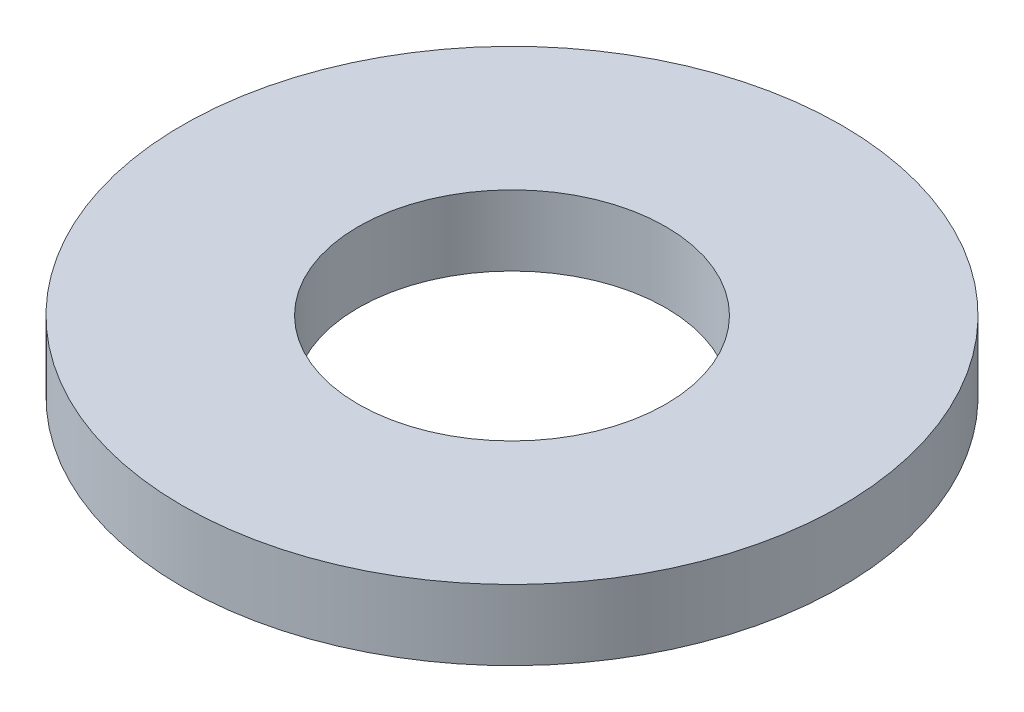
ISO-10303-21;
HEADER;
FILE_DESCRIPTION(('STEP AP214'),'2;1');
FILE_NAME('part.step','',(''),(''),'','','');
FILE_SCHEMA(('AUTOMOTIVE_DESIGN { 1 0 10303 214 1 1 1 1 }'));
ENDSEC;
DATA;
#1=APPLICATION_CONTEXT('core data for automotive mechanical design processes');
#2=APPLICATION_PROTOCOL_DEFINITION('international standard','automotive_design',2000,#1);
#3=PRODUCT_CONTEXT('',#1,'mechanical');
#4=PRODUCT('Part','Part','',(#3));
#5=PRODUCT_RELATED_PRODUCT_CATEGORY('part','',(#4));
#6=PRODUCT_DEFINITION_FORMATION('','',#4);
#7=PRODUCT_DEFINITION_CONTEXT('part definition',#1,'design');
#8=PRODUCT_DEFINITION('design','',#6,#7);
#9=PRODUCT_DEFINITION_SHAPE('','',#8);
#10=(LENGTH_UNIT() NAMED_UNIT(*) SI_UNIT(.MILLI.,.METRE.));
#11=(NAMED_UNIT(*) PLANE_ANGLE_UNIT() SI_UNIT($,.RADIAN.));
#12=(NAMED_UNIT(*) SI_UNIT($,.STERADIAN.) SOLID_ANGLE_UNIT());
#13=UNCERTAINTY_MEASURE_WITH_UNIT(LENGTH_MEASURE(1.E-05),#10,'distance_accuracy_value','');
#14=(GEOMETRIC_REPRESENTATION_CONTEXT(3) GLOBAL_UNCERTAINTY_ASSIGNED_CONTEXT((#13)) GLOBAL_UNIT_ASSIGNED_CONTEXT((#10,
#11,#12)) REPRESENTATION_CONTEXT('',''));
#15=CARTESIAN_POINT('',(0.,0.,0.));
#16=DIRECTION('',(0.,0.,1.));
#17=DIRECTION('',(1.,0.,0.));
#18=AXIS2_PLACEMENT_3D('',#15,#16,#17);
#19=CARTESIAN_POINT('',(0.,8.,0.));
#20=DIRECTION('',(0.,-1.,0.));
#21=DIRECTION('',(0.,0.,-1.));
#22=AXIS2_PLACEMENT_3D('',#19,#20,#21);
#23=CYLINDRICAL_SURFACE('',#22,37.5);
#24=CARTESIAN_POINT('',(0.,8.,0.));
#25=DIRECTION('',(0.,1.,0.));
#26=DIRECTION('',(0.,0.,1.));
#27=AXIS2_PLACEMENT_3D('',#24,#25,#26);
#28=CIRCLE('',#27,37.5);
#29=CARTESIAN_POINT('',(0.,8.,37.5));
#30=VERTEX_POINT('',#29);
#31=EDGE_CURVE('E10',#30,#30,#28,.T.);
#32=ORIENTED_EDGE('',*,*,#31,.F.);
#33=EDGE_LOOP('',(#32));
#34=FACE_BOUND('',#33,.T.);
#35=CARTESIAN_POINT('',(0.,0.,0.));
#36=DIRECTION('',(0.,1.,0.));
#37=DIRECTION('',(0.,0.,1.));
#38=AXIS2_PLACEMENT_3D('',#35,#36,#37);
#39=CIRCLE('',#38,37.5);
#40=CARTESIAN_POINT('',(0.,0.,37.5));
#41=VERTEX_POINT('',#40);
#42=EDGE_CURVE('E37',#41,#41,#39,.T.);
#43=ORIENTED_EDGE('',*,*,#42,.T.);
#44=EDGE_LOOP('',(#43));
#45=FACE_BOUND('',#44,.T.);
#46=ADVANCED_FACE('F40',(#34,#45),#23,.T.);
#47=CARTESIAN_POINT('',(0.,8.,0.));
#48=DIRECTION('',(0.,1.,0.));
#49=DIRECTION('',(0.,0.,1.));
#50=AXIS2_PLACEMENT_3D('',#47,#48,#49);
#51=PLANE('',#50);
#52=CARTESIAN_POINT('',(0.,8.,0.));
#53=DIRECTION('',(0.,1.,0.));
#54=DIRECTION('',(0.,0.,1.));
#55=AXIS2_PLACEMENT_3D('',#52,#53,#54);
#56=CIRCLE('',#55,17.5);
#57=CARTESIAN_POINT('',(0.,8.,17.5));
#58=VERTEX_POINT('',#57);
#59=EDGE_CURVE('E50',#58,#58,#56,.T.);
#60=ORIENTED_EDGE('',*,*,#59,.F.);
#61=EDGE_LOOP('',(#60));
#62=FACE_BOUND('',#61,.T.);
#63=ORIENTED_EDGE('',*,*,#31,.T.);
#64=EDGE_LOOP('',(#63));
#65=FACE_BOUND('',#64,.T.);
#66=ADVANCED_FACE('F59',(#62,#65),#51,.T.);
#67=CARTESIAN_POINT('',(0.,0.,0.));
#68=DIRECTION('',(0.,1.,0.));
#69=DIRECTION('',(0.,0.,1.));
#70=AXIS2_PLACEMENT_3D('',#67,#68,#69);
#71=PLANE('',#70);
#72=CARTESIAN_POINT('',(0.,0.,0.));
#73=DIRECTION('',(0.,1.,0.));
#74=DIRECTION('',(0.,0.,1.));
#75=AXIS2_PLACEMENT_3D('',#72,#73,#74);
#76=CIRCLE('',#75,17.5);
#77=CARTESIAN_POINT('',(0.,0.,17.5));
#78=VERTEX_POINT('',#77);
#79=EDGE_CURVE('E47',#78,#78,#76,.T.);
#80=ORIENTED_EDGE('',*,*,#79,.T.);
#81=EDGE_LOOP('',(#80));
#82=FACE_BOUND('',#81,.T.);
#83=ORIENTED_EDGE('',*,*,#42,.F.);
#84=EDGE_LOOP('',(#83));
#85=FACE_BOUND('',#84,.T.);
#86=ADVANCED_FACE('F58',(#82,#85),#71,.F.);
#87=CARTESIAN_POINT('',(0.,8.,0.));
#88=DIRECTION('',(0.,-1.,0.));
#89=DIRECTION('',(0.,0.,-1.));
#90=AXIS2_PLACEMENT_3D('',#87,#88,#89);
#91=CYLINDRICAL_SURFACE('',#90,17.5);
#92=ORIENTED_EDGE('',*,*,#59,.T.);
#93=EDGE_LOOP('',(#92));
#94=FACE_BOUND('',#93,.T.);
#95=ORIENTED_EDGE('',*,*,#79,.F.);
#96=EDGE_LOOP('',(#95));
#97=FACE_BOUND('',#96,.T.);
#98=ADVANCED_FACE('F54',(#94,#97),#91,.F.);
#99=CLOSED_SHELL('',(#46,#66,#86,#98));
#100=MANIFOLD_SOLID_BREP('B2',#99);
#101=ADVANCED_BREP_SHAPE_REPRESENTATION('',(#18,#100),#14);
#102=SHAPE_DEFINITION_REPRESENTATION(#9,#101);
ENDSEC;
END-ISO-10303-21;
